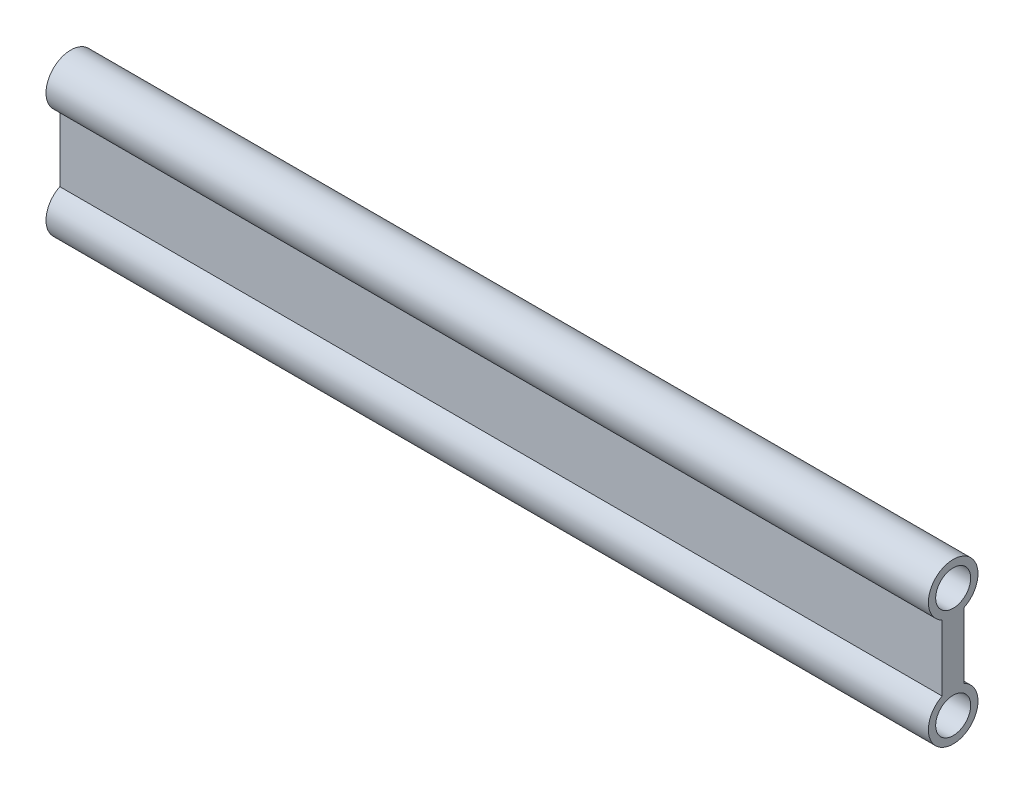
ISO-10303-21;
HEADER;
FILE_DESCRIPTION(('STEP AP214'),'2;1');
FILE_NAME('part.step','',(''),(''),'','','');
FILE_SCHEMA(('AUTOMOTIVE_DESIGN { 1 0 10303 214 1 1 1 1 }'));
ENDSEC;
DATA;
#1=APPLICATION_CONTEXT('core data for automotive mechanical design processes');
#2=APPLICATION_PROTOCOL_DEFINITION('international standard','automotive_design',2000,#1);
#3=PRODUCT_CONTEXT('',#1,'mechanical');
#4=PRODUCT('Part','Part','',(#3));
#5=PRODUCT_RELATED_PRODUCT_CATEGORY('part','',(#4));
#6=PRODUCT_DEFINITION_FORMATION('','',#4);
#7=PRODUCT_DEFINITION_CONTEXT('part definition',#1,'design');
#8=PRODUCT_DEFINITION('design','',#6,#7);
#9=PRODUCT_DEFINITION_SHAPE('','',#8);
#10=(LENGTH_UNIT() NAMED_UNIT(*) SI_UNIT(.MILLI.,.METRE.));
#11=(NAMED_UNIT(*) PLANE_ANGLE_UNIT() SI_UNIT($,.RADIAN.));
#12=(NAMED_UNIT(*) SI_UNIT($,.STERADIAN.) SOLID_ANGLE_UNIT());
#13=UNCERTAINTY_MEASURE_WITH_UNIT(LENGTH_MEASURE(1.E-05),#10,'distance_accuracy_value','');
#14=(GEOMETRIC_REPRESENTATION_CONTEXT(3) GLOBAL_UNCERTAINTY_ASSIGNED_CONTEXT((#13)) GLOBAL_UNIT_ASSIGNED_CONTEXT((#10,
#11,#12)) REPRESENTATION_CONTEXT('',''));
#15=CARTESIAN_POINT('',(0.,0.,0.));
#16=DIRECTION('',(0.,0.,1.));
#17=DIRECTION('',(1.,0.,0.));
#18=AXIS2_PLACEMENT_3D('',#15,#16,#17);
#19=CARTESIAN_POINT('',(160.,20.,0.));
#20=DIRECTION('',(1.,0.,0.));
#21=DIRECTION('',(0.,0.,-1.));
#22=AXIS2_PLACEMENT_3D('',#19,#20,#21);
#23=PLANE('',#22);
#24=CARTESIAN_POINT('',(160.,0.,0.));
#25=DIRECTION('',(1.,0.,0.));
#26=DIRECTION('',(0.,0.,-1.));
#27=AXIS2_PLACEMENT_3D('',#24,#25,#26);
#28=CIRCLE('',#27,3.175);
#29=CARTESIAN_POINT('',(160.,0.,-3.175));
#30=VERTEX_POINT('',#29);
#31=EDGE_CURVE('E106',#30,#30,#28,.T.);
#32=ORIENTED_EDGE('',*,*,#31,.F.);
#33=EDGE_LOOP('',(#32));
#34=FACE_BOUND('',#33,.T.);
#35=CARTESIAN_POINT('',(160.,20.,0.));
#36=DIRECTION('',(1.,0.,0.));
#37=DIRECTION('',(0.,0.,-1.));
#38=AXIS2_PLACEMENT_3D('',#35,#36,#37);
#39=CIRCLE('',#38,4.5);
#40=CARTESIAN_POINT('',(160.,15.9688711258507,-2.));
#41=VERTEX_POINT('',#40);
#42=CARTESIAN_POINT('',(160.,15.9688711258507,2.));
#43=VERTEX_POINT('',#42);
#44=EDGE_CURVE('E91',#41,#43,#39,.T.);
#45=ORIENTED_EDGE('',*,*,#44,.T.);
#46=DIRECTION('',(0.,-1.,0.));
#47=VECTOR('',#46,1.);
#48=CARTESIAN_POINT('',(160.,15.9688711258507,2.));
#49=LINE('',#48,#47);
#50=CARTESIAN_POINT('',(160.,4.03112887414927,2.));
#51=VERTEX_POINT('',#50);
#52=EDGE_CURVE('E86',#43,#51,#49,.T.);
#53=ORIENTED_EDGE('',*,*,#52,.T.);
#54=CARTESIAN_POINT('',(160.,0.,0.));
#55=DIRECTION('',(1.,0.,0.));
#56=DIRECTION('',(0.,0.,-1.));
#57=AXIS2_PLACEMENT_3D('',#54,#55,#56);
#58=CIRCLE('',#57,4.5);
#59=CARTESIAN_POINT('',(160.,4.03112887414928,-2.));
#60=VERTEX_POINT('',#59);
#61=EDGE_CURVE('E87',#51,#60,#58,.T.);
#62=ORIENTED_EDGE('',*,*,#61,.T.);
#63=DIRECTION('',(0.,1.,0.));
#64=VECTOR('',#63,1.);
#65=CARTESIAN_POINT('',(160.,15.9688711258507,-2.));
#66=LINE('',#65,#64);
#67=EDGE_CURVE('E57',#60,#41,#66,.T.);
#68=ORIENTED_EDGE('',*,*,#67,.T.);
#69=EDGE_LOOP('',(#45,#53,#62,#68));
#70=FACE_BOUND('',#69,.T.);
#71=CARTESIAN_POINT('',(160.,20.,0.));
#72=DIRECTION('',(1.,0.,0.));
#73=DIRECTION('',(0.,0.,-1.));
#74=AXIS2_PLACEMENT_3D('',#71,#72,#73);
#75=CIRCLE('',#74,3.175);
#76=CARTESIAN_POINT('',(160.,20.,-3.175));
#77=VERTEX_POINT('',#76);
#78=EDGE_CURVE('E123',#77,#77,#75,.T.);
#79=ORIENTED_EDGE('',*,*,#78,.F.);
#80=EDGE_LOOP('',(#79));
#81=FACE_BOUND('',#80,.T.);
#82=ADVANCED_FACE('F39',(#34,#70,#81),#23,.T.);
#83=CARTESIAN_POINT('',(0.,20.,0.));
#84=DIRECTION('',(1.,0.,0.));
#85=DIRECTION('',(0.,0.,-1.));
#86=AXIS2_PLACEMENT_3D('',#83,#84,#85);
#87=PLANE('',#86);
#88=CARTESIAN_POINT('',(0.,20.,0.));
#89=DIRECTION('',(1.,0.,0.));
#90=DIRECTION('',(0.,0.,-1.));
#91=AXIS2_PLACEMENT_3D('',#88,#89,#90);
#92=CIRCLE('',#91,4.5);
#93=CARTESIAN_POINT('',(0.,15.9688711258507,-2.));
#94=VERTEX_POINT('',#93);
#95=CARTESIAN_POINT('',(0.,15.9688711258507,2.));
#96=VERTEX_POINT('',#95);
#97=EDGE_CURVE('E104',#94,#96,#92,.T.);
#98=ORIENTED_EDGE('',*,*,#97,.F.);
#99=DIRECTION('',(0.,1.,0.));
#100=VECTOR('',#99,1.);
#101=CARTESIAN_POINT('',(0.,15.9688711258507,-2.));
#102=LINE('',#101,#100);
#103=CARTESIAN_POINT('',(0.,4.03112887414928,-2.));
#104=VERTEX_POINT('',#103);
#105=EDGE_CURVE('E80',#104,#94,#102,.T.);
#106=ORIENTED_EDGE('',*,*,#105,.F.);
#107=CARTESIAN_POINT('',(0.,0.,0.));
#108=DIRECTION('',(1.,0.,0.));
#109=DIRECTION('',(0.,0.,-1.));
#110=AXIS2_PLACEMENT_3D('',#107,#108,#109);
#111=CIRCLE('',#110,4.5);
#112=CARTESIAN_POINT('',(0.,4.03112887414927,2.));
#113=VERTEX_POINT('',#112);
#114=EDGE_CURVE('E74',#113,#104,#111,.T.);
#115=ORIENTED_EDGE('',*,*,#114,.F.);
#116=DIRECTION('',(0.,-1.,0.));
#117=VECTOR('',#116,1.);
#118=CARTESIAN_POINT('',(0.,15.9688711258507,2.));
#119=LINE('',#118,#117);
#120=EDGE_CURVE('E94',#96,#113,#119,.T.);
#121=ORIENTED_EDGE('',*,*,#120,.F.);
#122=EDGE_LOOP('',(#98,#106,#115,#121));
#123=FACE_BOUND('',#122,.T.);
#124=CARTESIAN_POINT('',(0.,0.,0.));
#125=DIRECTION('',(1.,0.,0.));
#126=DIRECTION('',(0.,0.,-1.));
#127=AXIS2_PLACEMENT_3D('',#124,#125,#126);
#128=CIRCLE('',#127,3.175);
#129=CARTESIAN_POINT('',(0.,0.,-3.175));
#130=VERTEX_POINT('',#129);
#131=EDGE_CURVE('E119',#130,#130,#128,.T.);
#132=ORIENTED_EDGE('',*,*,#131,.T.);
#133=EDGE_LOOP('',(#132));
#134=FACE_BOUND('',#133,.T.);
#135=CARTESIAN_POINT('',(0.,20.,0.));
#136=DIRECTION('',(1.,0.,0.));
#137=DIRECTION('',(0.,0.,-1.));
#138=AXIS2_PLACEMENT_3D('',#135,#136,#137);
#139=CIRCLE('',#138,3.175);
#140=CARTESIAN_POINT('',(0.,20.,-3.175));
#141=VERTEX_POINT('',#140);
#142=EDGE_CURVE('E125',#141,#141,#139,.T.);
#143=ORIENTED_EDGE('',*,*,#142,.T.);
#144=EDGE_LOOP('',(#143));
#145=FACE_BOUND('',#144,.T.);
#146=ADVANCED_FACE('F114',(#123,#134,#145),#87,.F.);
#147=CARTESIAN_POINT('',(160.,20.,0.));
#148=DIRECTION('',(-1.,0.,0.));
#149=DIRECTION('',(0.,0.,1.));
#150=AXIS2_PLACEMENT_3D('',#147,#148,#149);
#151=CYLINDRICAL_SURFACE('',#150,4.5);
#152=ORIENTED_EDGE('',*,*,#97,.T.);
#153=DIRECTION('',(-1.,0.,0.));
#154=VECTOR('',#153,1.);
#155=CARTESIAN_POINT('',(160.,15.9688711258507,2.));
#156=LINE('',#155,#154);
#157=EDGE_CURVE('E11',#43,#96,#156,.T.);
#158=ORIENTED_EDGE('',*,*,#157,.F.);
#159=ORIENTED_EDGE('',*,*,#44,.F.);
#160=DIRECTION('',(-1.,0.,0.));
#161=VECTOR('',#160,1.);
#162=CARTESIAN_POINT('',(160.,15.9688711258507,-2.));
#163=LINE('',#162,#161);
#164=EDGE_CURVE('E98',#41,#94,#163,.T.);
#165=ORIENTED_EDGE('',*,*,#164,.T.);
#166=EDGE_LOOP('',(#152,#158,#159,#165));
#167=FACE_BOUND('',#166,.T.);
#168=ADVANCED_FACE('F41',(#167),#151,.T.);
#169=CARTESIAN_POINT('',(160.,15.9688711258507,2.));
#170=DIRECTION('',(0.,0.,-1.));
#171=DIRECTION('',(0.,1.,0.));
#172=AXIS2_PLACEMENT_3D('',#169,#170,#171);
#173=PLANE('',#172);
#174=ORIENTED_EDGE('',*,*,#120,.T.);
#175=DIRECTION('',(-1.,0.,0.));
#176=VECTOR('',#175,1.);
#177=CARTESIAN_POINT('',(160.,4.03112887414927,2.));
#178=LINE('',#177,#176);
#179=EDGE_CURVE('E48',#51,#113,#178,.T.);
#180=ORIENTED_EDGE('',*,*,#179,.F.);
#181=ORIENTED_EDGE('',*,*,#52,.F.);
#182=ORIENTED_EDGE('',*,*,#157,.T.);
#183=EDGE_LOOP('',(#174,#180,#181,#182));
#184=FACE_BOUND('',#183,.T.);
#185=ADVANCED_FACE('F92',(#184),#173,.F.);
#186=CARTESIAN_POINT('',(160.,0.,0.));
#187=DIRECTION('',(-1.,0.,0.));
#188=DIRECTION('',(0.,0.,1.));
#189=AXIS2_PLACEMENT_3D('',#186,#187,#188);
#190=CYLINDRICAL_SURFACE('',#189,4.5);
#191=ORIENTED_EDGE('',*,*,#114,.T.);
#192=DIRECTION('',(-1.,0.,0.));
#193=VECTOR('',#192,1.);
#194=CARTESIAN_POINT('',(160.,4.03112887414928,-2.));
#195=LINE('',#194,#193);
#196=EDGE_CURVE('E96',#60,#104,#195,.T.);
#197=ORIENTED_EDGE('',*,*,#196,.F.);
#198=ORIENTED_EDGE('',*,*,#61,.F.);
#199=ORIENTED_EDGE('',*,*,#179,.T.);
#200=EDGE_LOOP('',(#191,#197,#198,#199));
#201=FACE_BOUND('',#200,.T.);
#202=ADVANCED_FACE('F100',(#201),#190,.T.);
#203=CARTESIAN_POINT('',(160.,15.9688711258507,-2.));
#204=DIRECTION('',(0.,0.,1.));
#205=DIRECTION('',(0.,-1.,0.));
#206=AXIS2_PLACEMENT_3D('',#203,#204,#205);
#207=PLANE('',#206);
#208=ORIENTED_EDGE('',*,*,#105,.T.);
#209=ORIENTED_EDGE('',*,*,#164,.F.);
#210=ORIENTED_EDGE('',*,*,#67,.F.);
#211=ORIENTED_EDGE('',*,*,#196,.T.);
#212=EDGE_LOOP('',(#208,#209,#210,#211));
#213=FACE_BOUND('',#212,.T.);
#214=ADVANCED_FACE('F112',(#213),#207,.F.);
#215=CARTESIAN_POINT('',(160.,0.,0.));
#216=DIRECTION('',(-1.,0.,0.));
#217=DIRECTION('',(0.,0.,1.));
#218=AXIS2_PLACEMENT_3D('',#215,#216,#217);
#219=CYLINDRICAL_SURFACE('',#218,3.175);
#220=ORIENTED_EDGE('',*,*,#31,.T.);
#221=EDGE_LOOP('',(#220));
#222=FACE_BOUND('',#221,.T.);
#223=ORIENTED_EDGE('',*,*,#131,.F.);
#224=EDGE_LOOP('',(#223));
#225=FACE_BOUND('',#224,.T.);
#226=ADVANCED_FACE('F141',(#222,#225),#219,.F.);
#227=CARTESIAN_POINT('',(160.,20.,0.));
#228=DIRECTION('',(-1.,0.,0.));
#229=DIRECTION('',(0.,0.,1.));
#230=AXIS2_PLACEMENT_3D('',#227,#228,#229);
#231=CYLINDRICAL_SURFACE('',#230,3.175);
#232=ORIENTED_EDGE('',*,*,#78,.T.);
#233=EDGE_LOOP('',(#232));
#234=FACE_BOUND('',#233,.T.);
#235=ORIENTED_EDGE('',*,*,#142,.F.);
#236=EDGE_LOOP('',(#235));
#237=FACE_BOUND('',#236,.T.);
#238=ADVANCED_FACE('F127',(#234,#237),#231,.F.);
#239=CLOSED_SHELL('',(#82,#146,#168,#185,#202,#214,#226,#238));
#240=MANIFOLD_SOLID_BREP('B2',#239);
#241=ADVANCED_BREP_SHAPE_REPRESENTATION('',(#18,#240),#14);
#242=SHAPE_DEFINITION_REPRESENTATION(#9,#241);
ENDSEC;
END-ISO-10303-21;
